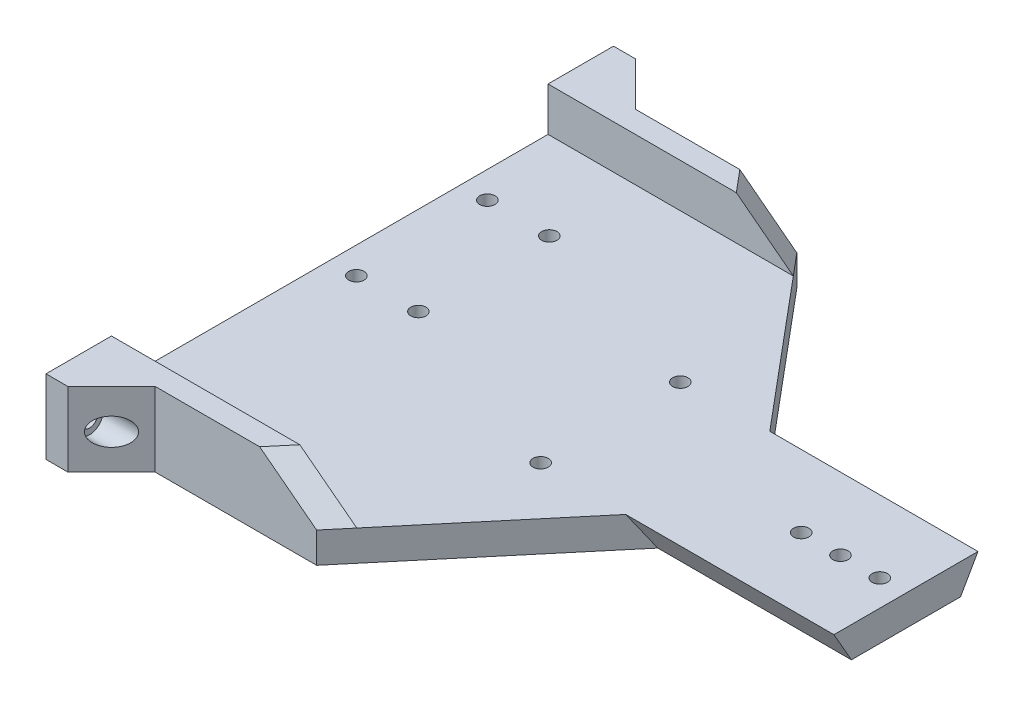
ISO-10303-21;
HEADER;
FILE_DESCRIPTION(('STEP AP214'),'2;1');
FILE_NAME('part.step','',(''),(''),'','','');
FILE_SCHEMA(('AUTOMOTIVE_DESIGN { 1 0 10303 214 1 1 1 1 }'));
ENDSEC;
DATA;
#1=APPLICATION_CONTEXT('core data for automotive mechanical design processes');
#2=APPLICATION_PROTOCOL_DEFINITION('international standard','automotive_design',2000,#1);
#3=PRODUCT_CONTEXT('',#1,'mechanical');
#4=PRODUCT('Part','Part','',(#3));
#5=PRODUCT_RELATED_PRODUCT_CATEGORY('part','',(#4));
#6=PRODUCT_DEFINITION_FORMATION('','',#4);
#7=PRODUCT_DEFINITION_CONTEXT('part definition',#1,'design');
#8=PRODUCT_DEFINITION('design','',#6,#7);
#9=PRODUCT_DEFINITION_SHAPE('','',#8);
#10=(LENGTH_UNIT() NAMED_UNIT(*) SI_UNIT(.MILLI.,.METRE.));
#11=(NAMED_UNIT(*) PLANE_ANGLE_UNIT() SI_UNIT($,.RADIAN.));
#12=(NAMED_UNIT(*) SI_UNIT($,.STERADIAN.) SOLID_ANGLE_UNIT());
#13=UNCERTAINTY_MEASURE_WITH_UNIT(LENGTH_MEASURE(1.E-05),#10,'distance_accuracy_value','');
#14=(GEOMETRIC_REPRESENTATION_CONTEXT(3) GLOBAL_UNCERTAINTY_ASSIGNED_CONTEXT((#13)) GLOBAL_UNIT_ASSIGNED_CONTEXT((#10,
#11,#12)) REPRESENTATION_CONTEXT('',''));
#15=CARTESIAN_POINT('',(0.,0.,0.));
#16=DIRECTION('',(0.,0.,1.));
#17=DIRECTION('',(1.,0.,0.));
#18=AXIS2_PLACEMENT_3D('',#15,#16,#17);
#19=CARTESIAN_POINT('',(150.,0.,0.));
#20=DIRECTION('',(1.,0.,0.));
#21=DIRECTION('',(0.,0.,-1.));
#22=AXIS2_PLACEMENT_3D('',#19,#20,#21);
#23=PLANE('',#22);
#24=CARTESIAN_POINT('',(150.,4.5,-72.5));
#25=DIRECTION('',(1.,0.,0.));
#26=DIRECTION('',(0.,0.,-1.));
#27=AXIS2_PLACEMENT_3D('',#24,#25,#26);
#28=CIRCLE('',#27,1.75);
#29=CARTESIAN_POINT('',(150.,4.5,-74.25));
#30=VERTEX_POINT('',#29);
#31=EDGE_CURVE('E42',#30,#30,#28,.T.);
#32=ORIENTED_EDGE('',*,*,#31,.T.);
#33=EDGE_LOOP('',(#32));
#34=FACE_BOUND('',#33,.T.);
#35=DIRECTION('',(0.,0.,-1.));
#36=VECTOR('',#35,1.);
#37=CARTESIAN_POINT('',(150.,3.5,0.));
#38=LINE('',#37,#36);
#39=CARTESIAN_POINT('',(150.,3.5,37.5));
#40=VERTEX_POINT('',#39);
#41=CARTESIAN_POINT('',(150.,3.5,-62.5));
#42=VERTEX_POINT('',#41);
#43=EDGE_CURVE('E47',#40,#42,#38,.T.);
#44=ORIENTED_EDGE('',*,*,#43,.T.);
#45=DIRECTION('',(0.,-1.,0.));
#46=VECTOR('',#45,1.);
#47=CARTESIAN_POINT('',(150.,13.5,-62.5));
#48=LINE('',#47,#46);
#49=CARTESIAN_POINT('',(150.,13.5,-62.5));
#50=VERTEX_POINT('',#49);
#51=EDGE_CURVE('E62',#50,#42,#48,.T.);
#52=ORIENTED_EDGE('',*,*,#51,.F.);
#53=DIRECTION('',(0.,0.,1.));
#54=VECTOR('',#53,1.);
#55=CARTESIAN_POINT('',(150.,13.5,0.));
#56=LINE('',#55,#54);
#57=CARTESIAN_POINT('',(150.,13.5,-77.5));
#58=VERTEX_POINT('',#57);
#59=EDGE_CURVE('E238',#58,#50,#56,.T.);
#60=ORIENTED_EDGE('',*,*,#59,.F.);
#61=DIRECTION('',(0.,1.,0.));
#62=VECTOR('',#61,1.);
#63=CARTESIAN_POINT('',(150.,13.5,-77.5));
#64=LINE('',#63,#62);
#65=CARTESIAN_POINT('',(150.,-3.5,-77.5));
#66=VERTEX_POINT('',#65);
#67=EDGE_CURVE('E220',#66,#58,#64,.T.);
#68=ORIENTED_EDGE('',*,*,#67,.F.);
#69=DIRECTION('',(0.,0.,-1.));
#70=VECTOR('',#69,1.);
#71=CARTESIAN_POINT('',(150.,-3.5,0.));
#72=LINE('',#71,#70);
#73=CARTESIAN_POINT('',(150.,-3.5,52.5));
#74=VERTEX_POINT('',#73);
#75=EDGE_CURVE('E241',#74,#66,#72,.T.);
#76=ORIENTED_EDGE('',*,*,#75,.F.);
#77=DIRECTION('',(0.,-1.,0.));
#78=VECTOR('',#77,1.);
#79=CARTESIAN_POINT('',(150.,13.5,52.5));
#80=LINE('',#79,#78);
#81=CARTESIAN_POINT('',(150.,13.5,52.5));
#82=VERTEX_POINT('',#81);
#83=EDGE_CURVE('E237',#82,#74,#80,.T.);
#84=ORIENTED_EDGE('',*,*,#83,.F.);
#85=DIRECTION('',(0.,0.,-1.));
#86=VECTOR('',#85,1.);
#87=CARTESIAN_POINT('',(150.,13.5,0.));
#88=LINE('',#87,#86);
#89=CARTESIAN_POINT('',(150.,13.5,37.5));
#90=VERTEX_POINT('',#89);
#91=EDGE_CURVE('E11',#82,#90,#88,.T.);
#92=ORIENTED_EDGE('',*,*,#91,.T.);
#93=DIRECTION('',(0.,1.,0.));
#94=VECTOR('',#93,1.);
#95=CARTESIAN_POINT('',(150.,13.5,37.5));
#96=LINE('',#95,#94);
#97=EDGE_CURVE('E55',#40,#90,#96,.T.);
#98=ORIENTED_EDGE('',*,*,#97,.F.);
#99=EDGE_LOOP('',(#44,#52,#60,#68,#76,#84,#92,#98));
#100=FACE_BOUND('',#99,.T.);
#101=CARTESIAN_POINT('',(150.,4.5,47.5));
#102=DIRECTION('',(1.,0.,0.));
#103=DIRECTION('',(0.,0.,-1.));
#104=AXIS2_PLACEMENT_3D('',#101,#102,#103);
#105=CIRCLE('',#104,1.75);
#106=CARTESIAN_POINT('',(150.,4.5,45.75));
#107=VERTEX_POINT('',#106);
#108=EDGE_CURVE('E243',#107,#107,#105,.F.);
#109=ORIENTED_EDGE('',*,*,#108,.F.);
#110=EDGE_LOOP('',(#109));
#111=FACE_BOUND('',#110,.T.);
#112=ADVANCED_FACE('F39',(#34,#100,#111),#23,.F.);
#113=CARTESIAN_POINT('',(282.,4.5,47.5));
#114=DIRECTION('',(-1.,0.,0.));
#115=DIRECTION('',(0.,0.,1.));
#116=AXIS2_PLACEMENT_3D('',#113,#114,#115);
#117=CYLINDRICAL_SURFACE('',#116,3.1);
#118=CARTESIAN_POINT('',(155.,4.5,47.5));
#119=DIRECTION('',(1.,0.,0.));
#120=DIRECTION('',(0.,0.,-1.));
#121=AXIS2_PLACEMENT_3D('',#118,#119,#120);
#122=CIRCLE('',#121,3.1);
#123=CARTESIAN_POINT('',(155.,4.5,44.4));
#124=VERTEX_POINT('',#123);
#125=EDGE_CURVE('E225',#124,#124,#122,.T.);
#126=ORIENTED_EDGE('',*,*,#125,.F.);
#127=EDGE_LOOP('',(#126));
#128=FACE_BOUND('',#127,.T.);
#129=CARTESIAN_POINT('',(160.,4.5,47.5));
#130=DIRECTION('',(-0.707106781186548,0.,-0.707106781186548));
#131=DIRECTION('',(-0.707106781186548,0.,0.707106781186548));
#132=AXIS2_PLACEMENT_3D('',#129,#130,#131);
#133=ELLIPSE('',#132,4.3840620433566,3.1);
#134=CARTESIAN_POINT('',(156.9,4.5,50.6));
#135=VERTEX_POINT('',#134);
#136=EDGE_CURVE('E224',#135,#135,#133,.F.);
#137=ORIENTED_EDGE('',*,*,#136,.T.);
#138=EDGE_LOOP('',(#137));
#139=FACE_BOUND('',#138,.T.);
#140=ADVANCED_FACE('F425',(#128,#139),#117,.F.);
#141=CARTESIAN_POINT('',(282.,4.5,-72.5));
#142=DIRECTION('',(-1.,0.,0.));
#143=DIRECTION('',(0.,0.,1.));
#144=AXIS2_PLACEMENT_3D('',#141,#142,#143);
#145=CYLINDRICAL_SURFACE('',#144,3.1);
#146=CARTESIAN_POINT('',(155.,4.5,-72.5));
#147=DIRECTION('',(-1.,0.,0.));
#148=DIRECTION('',(0.,0.,1.));
#149=AXIS2_PLACEMENT_3D('',#146,#147,#148);
#150=CIRCLE('',#149,3.1);
#151=CARTESIAN_POINT('',(155.,4.5,-69.4));
#152=VERTEX_POINT('',#151);
#153=EDGE_CURVE('E233',#152,#152,#150,.T.);
#154=ORIENTED_EDGE('',*,*,#153,.T.);
#155=EDGE_LOOP('',(#154));
#156=FACE_BOUND('',#155,.T.);
#157=CARTESIAN_POINT('',(160.,4.5,-72.5));
#158=DIRECTION('',(-0.707106781186548,0.,0.707106781186548));
#159=DIRECTION('',(-0.707106781186548,0.,-0.707106781186548));
#160=AXIS2_PLACEMENT_3D('',#157,#158,#159);
#161=ELLIPSE('',#160,4.3840620433566,3.1);
#162=CARTESIAN_POINT('',(156.9,4.5,-75.6));
#163=VERTEX_POINT('',#162);
#164=EDGE_CURVE('E232',#163,#163,#161,.T.);
#165=ORIENTED_EDGE('',*,*,#164,.F.);
#166=EDGE_LOOP('',(#165));
#167=FACE_BOUND('',#166,.T.);
#168=ADVANCED_FACE('F429',(#156,#167),#145,.F.);
#169=CARTESIAN_POINT('',(202.,3.5,42.5));
#170=DIRECTION('',(-0.766044443118982,0.,-0.642787609686535));
#171=DIRECTION('',(-0.642787609686535,0.,0.766044443118982));
#172=AXIS2_PLACEMENT_3D('',#169,#170,#171);
#173=PLANE('',#172);
#174=DIRECTION('',(0.642787609686535,0.,-0.766044443118982));
#175=VECTOR('',#174,1.);
#176=CARTESIAN_POINT('',(202.,3.5,42.5));
#177=LINE('',#176,#175);
#178=CARTESIAN_POINT('',(206.195498155886,3.5,37.5));
#179=VERTEX_POINT('',#178);
#180=CARTESIAN_POINT('',(234.305335800325,3.5,4.));
#181=VERTEX_POINT('',#180);
#182=EDGE_CURVE('E196',#179,#181,#177,.T.);
#183=ORIENTED_EDGE('',*,*,#182,.F.);
#184=DIRECTION('',(-0.642787609686535,0.,0.766044443118982));
#185=VECTOR('',#184,1.);
#186=CARTESIAN_POINT('',(202.,3.49999999999991,42.5));
#187=LINE('',#186,#185);
#188=CARTESIAN_POINT('',(202.,3.49999999999991,42.5));
#189=VERTEX_POINT('',#188);
#190=EDGE_CURVE('E216',#179,#189,#187,.T.);
#191=ORIENTED_EDGE('',*,*,#190,.T.);
#192=DIRECTION('',(0.,-1.,0.));
#193=VECTOR('',#192,1.);
#194=CARTESIAN_POINT('',(202.,3.5,42.5));
#195=LINE('',#194,#193);
#196=CARTESIAN_POINT('',(202.,-3.5,42.5));
#197=VERTEX_POINT('',#196);
#198=EDGE_CURVE('E199',#189,#197,#195,.T.);
#199=ORIENTED_EDGE('',*,*,#198,.T.);
#200=DIRECTION('',(0.642787609686535,0.,-0.766044443118982));
#201=VECTOR('',#200,1.);
#202=CARTESIAN_POINT('',(202.,-3.5,42.5));
#203=LINE('',#202,#201);
#204=CARTESIAN_POINT('',(237.661734325034,-3.5,0.));
#205=VERTEX_POINT('',#204);
#206=EDGE_CURVE('E349',#197,#205,#203,.T.);
#207=ORIENTED_EDGE('',*,*,#206,.T.);
#208=DIRECTION('',(0.384334803490757,-0.801556669933433,-0.458032382819104));
#209=VECTOR('',#208,1.);
#210=CARTESIAN_POINT('',(199.695039798349,75.6821530519329,45.2469446011045));
#211=LINE('',#210,#209);
#212=EDGE_CURVE('E289',#181,#205,#211,.T.);
#213=ORIENTED_EDGE('',*,*,#212,.F.);
#214=EDGE_LOOP('',(#183,#191,#199,#207,#213));
#215=FACE_BOUND('',#214,.T.);
#216=ADVANCED_FACE('F367',(#215),#173,.F.);
#217=CARTESIAN_POINT('',(-0.002000000000002,3.5,4.));
#218=DIRECTION('',(0.,-0.496138938356833,0.86824314212446));
#219=DIRECTION('',(0.,-0.86824314212446,-0.496138938356833));
#220=AXIS2_PLACEMENT_3D('',#217,#218,#219);
#221=PLANE('',#220);
#222=DIRECTION('',(1.,0.,0.));
#223=VECTOR('',#222,1.);
#224=CARTESIAN_POINT('',(-0.002000000000002,3.5,4.));
#225=LINE('',#224,#223);
#226=CARTESIAN_POINT('',(282.,3.5,4.));
#227=VERTEX_POINT('',#226);
#228=EDGE_CURVE('E292',#181,#227,#225,.T.);
#229=ORIENTED_EDGE('',*,*,#228,.F.);
#230=ORIENTED_EDGE('',*,*,#212,.T.);
#231=DIRECTION('',(1.,0.,0.));
#232=VECTOR('',#231,1.);
#233=CARTESIAN_POINT('',(282.,-3.5,0.));
#234=LINE('',#233,#232);
#235=CARTESIAN_POINT('',(282.,-3.5,0.));
#236=VERTEX_POINT('',#235);
#237=EDGE_CURVE('E191',#205,#236,#234,.T.);
#238=ORIENTED_EDGE('',*,*,#237,.T.);
#239=DIRECTION('',(0.,-0.86824314212446,-0.496138938356833));
#240=VECTOR('',#239,1.);
#241=CARTESIAN_POINT('',(282.,3.5,4.));
#242=LINE('',#241,#240);
#243=EDGE_CURVE('E293',#227,#236,#242,.T.);
#244=ORIENTED_EDGE('',*,*,#243,.F.);
#245=EDGE_LOOP('',(#229,#230,#238,#244));
#246=FACE_BOUND('',#245,.T.);
#247=ADVANCED_FACE('F355',(#246),#221,.T.);
#248=CARTESIAN_POINT('',(282.,3.5,-25.));
#249=DIRECTION('',(-1.,0.,0.));
#250=DIRECTION('',(0.,0.,1.));
#251=AXIS2_PLACEMENT_3D('',#248,#249,#250);
#252=PLANE('',#251);
#253=DIRECTION('',(0.,0.,-1.));
#254=VECTOR('',#253,1.);
#255=CARTESIAN_POINT('',(282.,-3.5,-25.));
#256=LINE('',#255,#254);
#257=CARTESIAN_POINT('',(282.,-3.5,-25.));
#258=VERTEX_POINT('',#257);
#259=EDGE_CURVE('E189',#236,#258,#256,.T.);
#260=ORIENTED_EDGE('',*,*,#259,.T.);
#261=DIRECTION('',(0.,0.86824314212446,-0.496138938356833));
#262=VECTOR('',#261,1.);
#263=CARTESIAN_POINT('',(282.,3.5,-29.));
#264=LINE('',#263,#262);
#265=CARTESIAN_POINT('',(282.,3.5,-29.));
#266=VERTEX_POINT('',#265);
#267=EDGE_CURVE('E188',#258,#266,#264,.T.);
#268=ORIENTED_EDGE('',*,*,#267,.T.);
#269=DIRECTION('',(0.,0.,-1.));
#270=VECTOR('',#269,1.);
#271=CARTESIAN_POINT('',(282.,3.5,-25.));
#272=LINE('',#271,#270);
#273=EDGE_CURVE('E344',#227,#266,#272,.T.);
#274=ORIENTED_EDGE('',*,*,#273,.F.);
#275=ORIENTED_EDGE('',*,*,#243,.T.);
#276=EDGE_LOOP('',(#260,#268,#274,#275));
#277=FACE_BOUND('',#276,.T.);
#278=ADVANCED_FACE('F358',(#277),#252,.F.);
#279=CARTESIAN_POINT('',(-0.002000000000002,3.5,-29.));
#280=DIRECTION('',(0.,-0.496138938356833,-0.86824314212446));
#281=DIRECTION('',(0.,0.86824314212446,-0.496138938356833));
#282=AXIS2_PLACEMENT_3D('',#279,#280,#281);
#283=PLANE('',#282);
#284=DIRECTION('',(-1.,0.,0.));
#285=VECTOR('',#284,1.);
#286=CARTESIAN_POINT('',(282.,-3.5,-25.));
#287=LINE('',#286,#285);
#288=CARTESIAN_POINT('',(237.661734325035,-3.5,-25.));
#289=VERTEX_POINT('',#288);
#290=EDGE_CURVE('E166',#258,#289,#287,.T.);
#291=ORIENTED_EDGE('',*,*,#290,.T.);
#292=DIRECTION('',(-0.384334803490762,0.801556669933432,-0.458032382819103));
#293=VECTOR('',#292,1.);
#294=CARTESIAN_POINT('',(199.695039798348,75.6821530519339,-70.246944601105));
#295=LINE('',#294,#293);
#296=CARTESIAN_POINT('',(234.305335800325,3.5,-29.));
#297=VERTEX_POINT('',#296);
#298=EDGE_CURVE('E175',#289,#297,#295,.T.);
#299=ORIENTED_EDGE('',*,*,#298,.T.);
#300=DIRECTION('',(1.,0.,0.));
#301=VECTOR('',#300,1.);
#302=CARTESIAN_POINT('',(-0.002000000000002,3.5,-29.));
#303=LINE('',#302,#301);
#304=EDGE_CURVE('E183',#297,#266,#303,.T.);
#305=ORIENTED_EDGE('',*,*,#304,.T.);
#306=ORIENTED_EDGE('',*,*,#267,.F.);
#307=EDGE_LOOP('',(#291,#299,#305,#306));
#308=FACE_BOUND('',#307,.T.);
#309=ADVANCED_FACE('F186',(#308),#283,.T.);
#310=CARTESIAN_POINT('',(202.,3.5,-67.5));
#311=DIRECTION('',(-0.766044443118976,0.,0.642787609686541));
#312=DIRECTION('',(0.642787609686541,0.,0.766044443118977));
#313=AXIS2_PLACEMENT_3D('',#310,#311,#312);
#314=PLANE('',#313);
#315=DIRECTION('',(0.,-1.,0.));
#316=VECTOR('',#315,1.);
#317=CARTESIAN_POINT('',(202.,3.5,-67.5));
#318=LINE('',#317,#316);
#319=CARTESIAN_POINT('',(202.,3.49999999999993,-67.5));
#320=VERTEX_POINT('',#319);
#321=CARTESIAN_POINT('',(202.,-3.5,-67.5));
#322=VERTEX_POINT('',#321);
#323=EDGE_CURVE('E197',#320,#322,#318,.T.);
#324=ORIENTED_EDGE('',*,*,#323,.F.);
#325=DIRECTION('',(0.642787609686541,0.,0.766044443118977));
#326=VECTOR('',#325,1.);
#327=CARTESIAN_POINT('',(202.,3.49999999999993,-67.5));
#328=LINE('',#327,#326);
#329=CARTESIAN_POINT('',(206.195498155886,3.5,-62.5));
#330=VERTEX_POINT('',#329);
#331=EDGE_CURVE('E214',#320,#330,#328,.T.);
#332=ORIENTED_EDGE('',*,*,#331,.T.);
#333=DIRECTION('',(-0.642787609686541,0.,-0.766044443118976));
#334=VECTOR('',#333,1.);
#335=CARTESIAN_POINT('',(202.,3.5,-67.5));
#336=LINE('',#335,#334);
#337=EDGE_CURVE('E179',#297,#330,#336,.T.);
#338=ORIENTED_EDGE('',*,*,#337,.F.);
#339=ORIENTED_EDGE('',*,*,#298,.F.);
#340=DIRECTION('',(-0.642787609686541,0.,-0.766044443118976));
#341=VECTOR('',#340,1.);
#342=CARTESIAN_POINT('',(202.,-3.5,-67.5));
#343=LINE('',#342,#341);
#344=EDGE_CURVE('E161',#289,#322,#343,.T.);
#345=ORIENTED_EDGE('',*,*,#344,.T.);
#346=EDGE_LOOP('',(#324,#332,#338,#339,#345));
#347=FACE_BOUND('',#346,.T.);
#348=ADVANCED_FACE('F176',(#347),#314,.F.);
#349=CARTESIAN_POINT('',(214.305335800325,-3.5,3.49999999999998));
#350=DIRECTION('',(0.,1.,0.));
#351=DIRECTION('',(0.,0.,1.));
#352=AXIS2_PLACEMENT_3D('',#349,#350,#351);
#353=CYLINDRICAL_SURFACE('',#352,1.74999999999998);
#354=CARTESIAN_POINT('',(214.305335800325,-3.5,3.49999999999998));
#355=DIRECTION('',(0.,1.,0.));
#356=DIRECTION('',(0.,0.,1.));
#357=AXIS2_PLACEMENT_3D('',#354,#355,#356);
#358=CIRCLE('',#357,1.74999999999998);
#359=CARTESIAN_POINT('',(214.305335800325,-3.5,5.24999999999996));
#360=VERTEX_POINT('',#359);
#361=EDGE_CURVE('E228',#360,#360,#358,.T.);
#362=ORIENTED_EDGE('',*,*,#361,.F.);
#363=EDGE_LOOP('',(#362));
#364=FACE_BOUND('',#363,.T.);
#365=CARTESIAN_POINT('',(214.305335800325,3.5,3.49999999999998));
#366=DIRECTION('',(0.,1.,0.));
#367=DIRECTION('',(0.,0.,1.));
#368=AXIS2_PLACEMENT_3D('',#365,#366,#367);
#369=CIRCLE('',#368,1.74999999999998);
#370=CARTESIAN_POINT('',(214.305335800325,3.5,5.24999999999996));
#371=VERTEX_POINT('',#370);
#372=EDGE_CURVE('E282',#371,#371,#369,.T.);
#373=ORIENTED_EDGE('',*,*,#372,.T.);
#374=EDGE_LOOP('',(#373));
#375=FACE_BOUND('',#374,.T.);
#376=ADVANCED_FACE('F446',(#364,#375),#353,.F.);
#377=CARTESIAN_POINT('',(214.305335800325,-3.5,-28.5));
#378=DIRECTION('',(0.,1.,0.));
#379=DIRECTION('',(0.,0.,1.));
#380=AXIS2_PLACEMENT_3D('',#377,#378,#379);
#381=CYLINDRICAL_SURFACE('',#380,1.74999999999998);
#382=CARTESIAN_POINT('',(214.305335800325,-3.5,-28.5));
#383=DIRECTION('',(0.,1.,0.));
#384=DIRECTION('',(0.,0.,1.));
#385=AXIS2_PLACEMENT_3D('',#382,#383,#384);
#386=CIRCLE('',#385,1.74999999999998);
#387=CARTESIAN_POINT('',(214.305335800325,-3.5,-26.75));
#388=VERTEX_POINT('',#387);
#389=EDGE_CURVE('E184',#388,#388,#386,.T.);
#390=ORIENTED_EDGE('',*,*,#389,.F.);
#391=EDGE_LOOP('',(#390));
#392=FACE_BOUND('',#391,.T.);
#393=CARTESIAN_POINT('',(214.305335800325,3.5,-28.5));
#394=DIRECTION('',(0.,1.,0.));
#395=DIRECTION('',(0.,0.,1.));
#396=AXIS2_PLACEMENT_3D('',#393,#394,#395);
#397=CIRCLE('',#396,1.74999999999998);
#398=CARTESIAN_POINT('',(214.305335800325,3.5,-26.75));
#399=VERTEX_POINT('',#398);
#400=EDGE_CURVE('E279',#399,#399,#397,.T.);
#401=ORIENTED_EDGE('',*,*,#400,.T.);
#402=EDGE_LOOP('',(#401));
#403=FACE_BOUND('',#402,.T.);
#404=ADVANCED_FACE('F442',(#392,#403),#381,.F.);
#405=CARTESIAN_POINT('',(276.,-3.5,-12.5));
#406=DIRECTION('',(0.,1.,0.));
#407=DIRECTION('',(0.,0.,1.));
#408=AXIS2_PLACEMENT_3D('',#405,#406,#407);
#409=CYLINDRICAL_SURFACE('',#408,1.75000000000004);
#410=CARTESIAN_POINT('',(276.,-3.5,-12.5));
#411=DIRECTION('',(0.,1.,0.));
#412=DIRECTION('',(0.,0.,1.));
#413=AXIS2_PLACEMENT_3D('',#410,#411,#412);
#414=CIRCLE('',#413,1.75000000000004);
#415=CARTESIAN_POINT('',(276.,-3.5,-10.75));
#416=VERTEX_POINT('',#415);
#417=EDGE_CURVE('E856',#416,#416,#414,.T.);
#418=ORIENTED_EDGE('',*,*,#417,.F.);
#419=EDGE_LOOP('',(#418));
#420=FACE_BOUND('',#419,.T.);
#421=CARTESIAN_POINT('',(276.,3.5,-12.5));
#422=DIRECTION('',(0.,1.,0.));
#423=DIRECTION('',(0.,0.,1.));
#424=AXIS2_PLACEMENT_3D('',#421,#422,#423);
#425=CIRCLE('',#424,1.75000000000004);
#426=CARTESIAN_POINT('',(276.,3.5,-10.75));
#427=VERTEX_POINT('',#426);
#428=EDGE_CURVE('E848',#427,#427,#425,.T.);
#429=ORIENTED_EDGE('',*,*,#428,.T.);
#430=EDGE_LOOP('',(#429));
#431=FACE_BOUND('',#430,.T.);
#432=ADVANCED_FACE('F445',(#420,#431),#409,.F.);
#433=CARTESIAN_POINT('',(267.,-3.5,-12.5));
#434=DIRECTION('',(0.,1.,0.));
#435=DIRECTION('',(0.,0.,1.));
#436=AXIS2_PLACEMENT_3D('',#433,#434,#435);
#437=CYLINDRICAL_SURFACE('',#436,1.74999999999998);
#438=CARTESIAN_POINT('',(267.,-3.5,-12.5));
#439=DIRECTION('',(0.,1.,0.));
#440=DIRECTION('',(0.,0.,1.));
#441=AXIS2_PLACEMENT_3D('',#438,#439,#440);
#442=CIRCLE('',#441,1.74999999999998);
#443=CARTESIAN_POINT('',(267.,-3.5,-10.75));
#444=VERTEX_POINT('',#443);
#445=EDGE_CURVE('E855',#444,#444,#442,.T.);
#446=ORIENTED_EDGE('',*,*,#445,.F.);
#447=EDGE_LOOP('',(#446));
#448=FACE_BOUND('',#447,.T.);
#449=CARTESIAN_POINT('',(267.,3.5,-12.5));
#450=DIRECTION('',(0.,1.,0.));
#451=DIRECTION('',(0.,0.,1.));
#452=AXIS2_PLACEMENT_3D('',#449,#450,#451);
#453=CIRCLE('',#452,1.74999999999998);
#454=CARTESIAN_POINT('',(267.,3.5,-10.75));
#455=VERTEX_POINT('',#454);
#456=EDGE_CURVE('E844',#455,#455,#453,.T.);
#457=ORIENTED_EDGE('',*,*,#456,.T.);
#458=EDGE_LOOP('',(#457));
#459=FACE_BOUND('',#458,.T.);
#460=ADVANCED_FACE('F712',(#448,#459),#437,.F.);
#461=CARTESIAN_POINT('',(258.,-3.5,-12.5));
#462=DIRECTION('',(0.,1.,0.));
#463=DIRECTION('',(0.,0.,1.));
#464=AXIS2_PLACEMENT_3D('',#461,#462,#463);
#465=CYLINDRICAL_SURFACE('',#464,1.75000000000004);
#466=CARTESIAN_POINT('',(258.,-3.5,-12.5));
#467=DIRECTION('',(0.,1.,0.));
#468=DIRECTION('',(0.,0.,1.));
#469=AXIS2_PLACEMENT_3D('',#466,#467,#468);
#470=CIRCLE('',#469,1.75000000000004);
#471=CARTESIAN_POINT('',(258.,-3.5,-10.75));
#472=VERTEX_POINT('',#471);
#473=EDGE_CURVE('E884',#472,#472,#470,.T.);
#474=ORIENTED_EDGE('',*,*,#473,.F.);
#475=EDGE_LOOP('',(#474));
#476=FACE_BOUND('',#475,.T.);
#477=CARTESIAN_POINT('',(258.,3.5,-12.5));
#478=DIRECTION('',(0.,1.,0.));
#479=DIRECTION('',(0.,0.,1.));
#480=AXIS2_PLACEMENT_3D('',#477,#478,#479);
#481=CIRCLE('',#480,1.75000000000004);
#482=CARTESIAN_POINT('',(258.,3.5,-10.75));
#483=VERTEX_POINT('',#482);
#484=EDGE_CURVE('E840',#483,#483,#481,.T.);
#485=ORIENTED_EDGE('',*,*,#484,.T.);
#486=EDGE_LOOP('',(#485));
#487=FACE_BOUND('',#486,.T.);
#488=ADVANCED_FACE('F723',(#476,#487),#465,.F.);
#489=CARTESIAN_POINT('',(170.3,-3.5,-42.5));
#490=DIRECTION('',(0.,1.,0.));
#491=DIRECTION('',(0.,0.,1.));
#492=AXIS2_PLACEMENT_3D('',#489,#490,#491);
#493=CYLINDRICAL_SURFACE('',#492,1.75000000000001);
#494=CARTESIAN_POINT('',(170.3,-3.5,-42.5));
#495=DIRECTION('',(0.,1.,0.));
#496=DIRECTION('',(0.,0.,1.));
#497=AXIS2_PLACEMENT_3D('',#494,#495,#496);
#498=CIRCLE('',#497,1.75000000000001);
#499=CARTESIAN_POINT('',(170.3,-3.5,-40.75));
#500=VERTEX_POINT('',#499);
#501=EDGE_CURVE('E870',#500,#500,#498,.T.);
#502=ORIENTED_EDGE('',*,*,#501,.F.);
#503=EDGE_LOOP('',(#502));
#504=FACE_BOUND('',#503,.T.);
#505=CARTESIAN_POINT('',(170.3,3.5,-42.5));
#506=DIRECTION('',(0.,1.,0.));
#507=DIRECTION('',(0.,0.,1.));
#508=AXIS2_PLACEMENT_3D('',#505,#506,#507);
#509=CIRCLE('',#508,1.75000000000001);
#510=CARTESIAN_POINT('',(170.3,3.5,-40.75));
#511=VERTEX_POINT('',#510);
#512=EDGE_CURVE('E836',#511,#511,#509,.T.);
#513=ORIENTED_EDGE('',*,*,#512,.T.);
#514=EDGE_LOOP('',(#513));
#515=FACE_BOUND('',#514,.T.);
#516=ADVANCED_FACE('F734',(#504,#515),#493,.F.);
#517=CARTESIAN_POINT('',(156.1,-3.5,-12.5));
#518=DIRECTION('',(0.,1.,0.));
#519=DIRECTION('',(0.,0.,1.));
#520=AXIS2_PLACEMENT_3D('',#517,#518,#519);
#521=CYLINDRICAL_SURFACE('',#520,1.75000000000001);
#522=CARTESIAN_POINT('',(156.1,-3.5,-12.5));
#523=DIRECTION('',(0.,1.,0.));
#524=DIRECTION('',(0.,0.,1.));
#525=AXIS2_PLACEMENT_3D('',#522,#523,#524);
#526=CIRCLE('',#525,1.75000000000001);
#527=CARTESIAN_POINT('',(156.1,-3.5,-10.75));
#528=VERTEX_POINT('',#527);
#529=EDGE_CURVE('E865',#528,#528,#526,.T.);
#530=ORIENTED_EDGE('',*,*,#529,.F.);
#531=EDGE_LOOP('',(#530));
#532=FACE_BOUND('',#531,.T.);
#533=CARTESIAN_POINT('',(156.1,3.5,-12.5));
#534=DIRECTION('',(0.,1.,0.));
#535=DIRECTION('',(0.,0.,1.));
#536=AXIS2_PLACEMENT_3D('',#533,#534,#535);
#537=CIRCLE('',#536,1.75000000000001);
#538=CARTESIAN_POINT('',(156.1,3.5,-10.75));
#539=VERTEX_POINT('',#538);
#540=EDGE_CURVE('E832',#539,#539,#537,.T.);
#541=ORIENTED_EDGE('',*,*,#540,.T.);
#542=EDGE_LOOP('',(#541));
#543=FACE_BOUND('',#542,.T.);
#544=ADVANCED_FACE('F745',(#532,#543),#521,.F.);
#545=CARTESIAN_POINT('',(170.3,-3.5,-12.5));
#546=DIRECTION('',(0.,1.,0.));
#547=DIRECTION('',(0.,0.,1.));
#548=AXIS2_PLACEMENT_3D('',#545,#546,#547);
#549=CYLINDRICAL_SURFACE('',#548,1.75000000000001);
#550=CARTESIAN_POINT('',(170.3,-3.5,-12.5));
#551=DIRECTION('',(0.,1.,0.));
#552=DIRECTION('',(0.,0.,1.));
#553=AXIS2_PLACEMENT_3D('',#550,#551,#552);
#554=CIRCLE('',#553,1.75000000000001);
#555=CARTESIAN_POINT('',(170.3,-3.5,-10.75));
#556=VERTEX_POINT('',#555);
#557=EDGE_CURVE('E866',#556,#556,#554,.T.);
#558=ORIENTED_EDGE('',*,*,#557,.F.);
#559=EDGE_LOOP('',(#558));
#560=FACE_BOUND('',#559,.T.);
#561=CARTESIAN_POINT('',(170.3,3.5,-12.5));
#562=DIRECTION('',(0.,1.,0.));
#563=DIRECTION('',(0.,0.,1.));
#564=AXIS2_PLACEMENT_3D('',#561,#562,#563);
#565=CIRCLE('',#564,1.75000000000001);
#566=CARTESIAN_POINT('',(170.3,3.5,-10.75));
#567=VERTEX_POINT('',#566);
#568=EDGE_CURVE('E828',#567,#567,#565,.T.);
#569=ORIENTED_EDGE('',*,*,#568,.T.);
#570=EDGE_LOOP('',(#569));
#571=FACE_BOUND('',#570,.T.);
#572=ADVANCED_FACE('F756',(#560,#571),#549,.F.);
#573=CARTESIAN_POINT('',(156.1,-3.5,-42.5));
#574=DIRECTION('',(0.,1.,0.));
#575=DIRECTION('',(0.,0.,1.));
#576=AXIS2_PLACEMENT_3D('',#573,#574,#575);
#577=CYLINDRICAL_SURFACE('',#576,1.75000000000001);
#578=CARTESIAN_POINT('',(156.1,-3.5,-42.5));
#579=DIRECTION('',(0.,1.,0.));
#580=DIRECTION('',(0.,0.,1.));
#581=AXIS2_PLACEMENT_3D('',#578,#579,#580);
#582=CIRCLE('',#581,1.75000000000001);
#583=CARTESIAN_POINT('',(156.1,-3.5,-40.75));
#584=VERTEX_POINT('',#583);
#585=EDGE_CURVE('E271',#584,#584,#582,.T.);
#586=ORIENTED_EDGE('',*,*,#585,.F.);
#587=EDGE_LOOP('',(#586));
#588=FACE_BOUND('',#587,.T.);
#589=CARTESIAN_POINT('',(156.1,3.5,-42.5));
#590=DIRECTION('',(0.,1.,0.));
#591=DIRECTION('',(0.,0.,1.));
#592=AXIS2_PLACEMENT_3D('',#589,#590,#591);
#593=CIRCLE('',#592,1.75000000000001);
#594=CARTESIAN_POINT('',(156.1,3.5,-40.75));
#595=VERTEX_POINT('',#594);
#596=EDGE_CURVE('E268',#595,#595,#593,.T.);
#597=ORIENTED_EDGE('',*,*,#596,.T.);
#598=EDGE_LOOP('',(#597));
#599=FACE_BOUND('',#598,.T.);
#600=ADVANCED_FACE('F477',(#588,#599),#577,.F.);
#601=CARTESIAN_POINT('',(52.,3.5,-67.5));
#602=DIRECTION('',(0.,0.,1.));
#603=DIRECTION('',(1.,0.,0.));
#604=AXIS2_PLACEMENT_3D('',#601,#602,#603);
#605=PLANE('',#604);
#606=DIRECTION('',(-1.,0.,0.));
#607=VECTOR('',#606,1.);
#608=CARTESIAN_POINT('',(52.,13.5,-67.5));
#609=LINE('',#608,#607);
#610=CARTESIAN_POINT('',(188.945927106677,13.5,-67.5));
#611=VERTEX_POINT('',#610);
#612=CARTESIAN_POINT('',(165.,13.5,-67.5));
#613=VERTEX_POINT('',#612);
#614=EDGE_CURVE('E338',#611,#613,#609,.T.);
#615=ORIENTED_EDGE('',*,*,#614,.F.);
#616=DIRECTION('',(-0.793844806099451,0.608120402411336,0.));
#617=VECTOR('',#616,1.);
#618=CARTESIAN_POINT('',(160.694122609366,35.1421378432481,-67.5));
#619=LINE('',#618,#617);
#620=EDGE_CURVE('E212',#611,#320,#619,.F.);
#621=ORIENTED_EDGE('',*,*,#620,.T.);
#622=ORIENTED_EDGE('',*,*,#323,.T.);
#623=DIRECTION('',(-1.,0.,0.));
#624=VECTOR('',#623,1.);
#625=CARTESIAN_POINT('',(52.,-3.5,-67.5));
#626=LINE('',#625,#624);
#627=CARTESIAN_POINT('',(165.,-3.5,-67.5));
#628=VERTEX_POINT('',#627);
#629=EDGE_CURVE('E170',#322,#628,#626,.T.);
#630=ORIENTED_EDGE('',*,*,#629,.T.);
#631=DIRECTION('',(0.,-1.,0.));
#632=VECTOR('',#631,1.);
#633=CARTESIAN_POINT('',(165.,13.5,-67.5));
#634=LINE('',#633,#632);
#635=EDGE_CURVE('E296',#613,#628,#634,.T.);
#636=ORIENTED_EDGE('',*,*,#635,.F.);
#637=EDGE_LOOP('',(#615,#621,#622,#630,#636));
#638=FACE_BOUND('',#637,.T.);
#639=ADVANCED_FACE('F399',(#638),#605,.F.);
#640=CARTESIAN_POINT('',(144.115283177332,13.5,-120.927080961109));
#641=DIRECTION('',(-0.541675220419697,-0.707106781186553,0.454519477672042));
#642=DIRECTION('',(-0.642787609686541,0.,-0.766044443118977));
#643=AXIS2_PLACEMENT_3D('',#640,#641,#642);
#644=PLANE('',#643);
#645=DIRECTION('',(0.79384480609945,-0.608120402411336,0.));
#646=VECTOR('',#645,1.);
#647=CARTESIAN_POINT('',(162.245661560568,37.1675280998299,-62.5));
#648=LINE('',#647,#646);
#649=CARTESIAN_POINT('',(193.141425262563,13.5,-62.5));
#650=VERTEX_POINT('',#649);
#651=EDGE_CURVE('E209',#330,#650,#648,.F.);
#652=ORIENTED_EDGE('',*,*,#651,.F.);
#653=ORIENTED_EDGE('',*,*,#331,.F.);
#654=ORIENTED_EDGE('',*,*,#620,.F.);
#655=DIRECTION('',(-0.642787609686541,0.,-0.766044443118977));
#656=VECTOR('',#655,1.);
#657=CARTESIAN_POINT('',(144.115283177332,13.5,-120.927080961109));
#658=LINE('',#657,#656);
#659=EDGE_CURVE('E206',#650,#611,#658,.T.);
#660=ORIENTED_EDGE('',*,*,#659,.F.);
#661=EDGE_LOOP('',(#652,#653,#654,#660));
#662=FACE_BOUND('',#661,.T.);
#663=ADVANCED_FACE('F403',(#662),#644,.F.);
#664=CARTESIAN_POINT('',(206.195498155886,13.5,-62.5));
#665=DIRECTION('',(0.,0.,-1.));
#666=DIRECTION('',(-1.,0.,0.));
#667=AXIS2_PLACEMENT_3D('',#664,#665,#666);
#668=PLANE('',#667);
#669=DIRECTION('',(1.,0.,0.));
#670=VECTOR('',#669,1.);
#671=CARTESIAN_POINT('',(206.195498155886,13.5,-62.5));
#672=LINE('',#671,#670);
#673=EDGE_CURVE('E336',#50,#650,#672,.T.);
#674=ORIENTED_EDGE('',*,*,#673,.F.);
#675=ORIENTED_EDGE('',*,*,#51,.T.);
#676=DIRECTION('',(1.,0.,0.));
#677=VECTOR('',#676,1.);
#678=CARTESIAN_POINT('',(206.195498155886,3.5,-62.5));
#679=LINE('',#678,#677);
#680=EDGE_CURVE('E330',#42,#330,#679,.T.);
#681=ORIENTED_EDGE('',*,*,#680,.T.);
#682=ORIENTED_EDGE('',*,*,#651,.T.);
#683=EDGE_LOOP('',(#674,#675,#681,#682));
#684=FACE_BOUND('',#683,.T.);
#685=ADVANCED_FACE('F405',(#684),#668,.F.);
#686=CARTESIAN_POINT('',(0.,3.5,0.));
#687=DIRECTION('',(0.,1.,0.));
#688=DIRECTION('',(0.,0.,1.));
#689=AXIS2_PLACEMENT_3D('',#686,#687,#688);
#690=PLANE('',#689);
#691=ORIENTED_EDGE('',*,*,#43,.F.);
#692=DIRECTION('',(-1.,0.,0.));
#693=VECTOR('',#692,1.);
#694=CARTESIAN_POINT('',(206.195498155886,3.5,37.5));
#695=LINE('',#694,#693);
#696=EDGE_CURVE('E328',#179,#40,#695,.T.);
#697=ORIENTED_EDGE('',*,*,#696,.F.);
#698=ORIENTED_EDGE('',*,*,#182,.T.);
#699=ORIENTED_EDGE('',*,*,#228,.T.);
#700=ORIENTED_EDGE('',*,*,#273,.T.);
#701=ORIENTED_EDGE('',*,*,#304,.F.);
#702=ORIENTED_EDGE('',*,*,#337,.T.);
#703=ORIENTED_EDGE('',*,*,#680,.F.);
#704=EDGE_LOOP('',(#691,#697,#698,#699,#700,#701,#702,#703));
#705=FACE_BOUND('',#704,.T.);
#706=ORIENTED_EDGE('',*,*,#596,.F.);
#707=EDGE_LOOP('',(#706));
#708=FACE_BOUND('',#707,.T.);
#709=ORIENTED_EDGE('',*,*,#568,.F.);
#710=EDGE_LOOP('',(#709));
#711=FACE_BOUND('',#710,.T.);
#712=ORIENTED_EDGE('',*,*,#540,.F.);
#713=EDGE_LOOP('',(#712));
#714=FACE_BOUND('',#713,.T.);
#715=ORIENTED_EDGE('',*,*,#512,.F.);
#716=EDGE_LOOP('',(#715));
#717=FACE_BOUND('',#716,.T.);
#718=ORIENTED_EDGE('',*,*,#484,.F.);
#719=EDGE_LOOP('',(#718));
#720=FACE_BOUND('',#719,.T.);
#721=ORIENTED_EDGE('',*,*,#456,.F.);
#722=EDGE_LOOP('',(#721));
#723=FACE_BOUND('',#722,.T.);
#724=ORIENTED_EDGE('',*,*,#428,.F.);
#725=EDGE_LOOP('',(#724));
#726=FACE_BOUND('',#725,.T.);
#727=ORIENTED_EDGE('',*,*,#400,.F.);
#728=EDGE_LOOP('',(#727));
#729=FACE_BOUND('',#728,.T.);
#730=ORIENTED_EDGE('',*,*,#372,.F.);
#731=EDGE_LOOP('',(#730));
#732=FACE_BOUND('',#731,.T.);
#733=ADVANCED_FACE('F361',(#705,#708,#711,#714,#717,#720,#723,#726,#729,#732),#690,.T.);
#734=CARTESIAN_POINT('',(206.195498155886,13.5,37.5));
#735=DIRECTION('',(0.,0.,1.));
#736=DIRECTION('',(1.,0.,0.));
#737=AXIS2_PLACEMENT_3D('',#734,#735,#736);
#738=PLANE('',#737);
#739=ORIENTED_EDGE('',*,*,#696,.T.);
#740=ORIENTED_EDGE('',*,*,#97,.T.);
#741=DIRECTION('',(-1.,0.,0.));
#742=VECTOR('',#741,1.);
#743=CARTESIAN_POINT('',(206.195498155886,13.5,37.5));
#744=LINE('',#743,#742);
#745=CARTESIAN_POINT('',(193.141425262563,13.5,37.5));
#746=VERTEX_POINT('',#745);
#747=EDGE_CURVE('E331',#746,#90,#744,.T.);
#748=ORIENTED_EDGE('',*,*,#747,.F.);
#749=DIRECTION('',(0.793844806099447,-0.608120402411342,0.));
#750=VECTOR('',#749,1.);
#751=CARTESIAN_POINT('',(154.48796680456,43.1102670590834,37.5));
#752=LINE('',#751,#750);
#753=EDGE_CURVE('E204',#746,#179,#752,.T.);
#754=ORIENTED_EDGE('',*,*,#753,.T.);
#755=EDGE_LOOP('',(#739,#740,#748,#754));
#756=FACE_BOUND('',#755,.T.);
#757=ADVANCED_FACE('F407',(#756),#738,.F.);
#758=CARTESIAN_POINT('',(131.805186264681,13.5,110.597683181945));
#759=DIRECTION('',(0.541675220419702,0.707106781186551,0.454519477672039));
#760=DIRECTION('',(-0.642787609686535,0.,0.766044443118982));
#761=AXIS2_PLACEMENT_3D('',#758,#759,#760);
#762=PLANE('',#761);
#763=DIRECTION('',(-0.793844806099447,0.608120402411341,0.));
#764=VECTOR('',#763,1.);
#765=CARTESIAN_POINT('',(152.936427853358,41.0848768025016,42.5));
#766=LINE('',#765,#764);
#767=CARTESIAN_POINT('',(188.945927106677,13.5,42.5));
#768=VERTEX_POINT('',#767);
#769=EDGE_CURVE('E218',#189,#768,#766,.T.);
#770=ORIENTED_EDGE('',*,*,#769,.F.);
#771=ORIENTED_EDGE('',*,*,#190,.F.);
#772=ORIENTED_EDGE('',*,*,#753,.F.);
#773=DIRECTION('',(0.642787609686535,0.,-0.766044443118982));
#774=VECTOR('',#773,1.);
#775=CARTESIAN_POINT('',(198.535053724696,13.5,31.0721239031345));
#776=LINE('',#775,#774);
#777=EDGE_CURVE('E201',#768,#746,#776,.T.);
#778=ORIENTED_EDGE('',*,*,#777,.F.);
#779=EDGE_LOOP('',(#770,#771,#772,#778));
#780=FACE_BOUND('',#779,.T.);
#781=ADVANCED_FACE('F410',(#780),#762,.T.);
#782=CARTESIAN_POINT('',(52.,3.5,42.5));
#783=DIRECTION('',(0.,0.,-1.));
#784=DIRECTION('',(-1.,0.,0.));
#785=AXIS2_PLACEMENT_3D('',#782,#783,#784);
#786=PLANE('',#785);
#787=ORIENTED_EDGE('',*,*,#198,.F.);
#788=ORIENTED_EDGE('',*,*,#769,.T.);
#789=DIRECTION('',(1.,0.,0.));
#790=VECTOR('',#789,1.);
#791=CARTESIAN_POINT('',(52.,13.5,42.5));
#792=LINE('',#791,#790);
#793=CARTESIAN_POINT('',(165.,13.5,42.5));
#794=VERTEX_POINT('',#793);
#795=EDGE_CURVE('E327',#794,#768,#792,.T.);
#796=ORIENTED_EDGE('',*,*,#795,.F.);
#797=DIRECTION('',(0.,-1.,0.));
#798=VECTOR('',#797,1.);
#799=CARTESIAN_POINT('',(165.,13.5,42.5));
#800=LINE('',#799,#798);
#801=CARTESIAN_POINT('',(165.,-3.5,42.5));
#802=VERTEX_POINT('',#801);
#803=EDGE_CURVE('E324',#794,#802,#800,.T.);
#804=ORIENTED_EDGE('',*,*,#803,.T.);
#805=DIRECTION('',(1.,0.,0.));
#806=VECTOR('',#805,1.);
#807=CARTESIAN_POINT('',(52.,-3.5,42.5));
#808=LINE('',#807,#806);
#809=EDGE_CURVE('E340',#802,#197,#808,.T.);
#810=ORIENTED_EDGE('',*,*,#809,.T.);
#811=EDGE_LOOP('',(#787,#788,#796,#804,#810));
#812=FACE_BOUND('',#811,.T.);
#813=ADVANCED_FACE('F372',(#812),#786,.F.);
#814=CARTESIAN_POINT('',(155.,13.5,52.5));
#815=DIRECTION('',(-0.707106781186548,0.,-0.707106781186548));
#816=DIRECTION('',(-0.707106781186548,0.,0.707106781186548));
#817=AXIS2_PLACEMENT_3D('',#814,#815,#816);
#818=PLANE('',#817);
#819=ORIENTED_EDGE('',*,*,#136,.F.);
#820=EDGE_LOOP('',(#819));
#821=FACE_BOUND('',#820,.T.);
#822=DIRECTION('',(0.707106781186547,0.,-0.707106781186547));
#823=VECTOR('',#822,1.);
#824=CARTESIAN_POINT('',(155.,-3.5,52.5));
#825=LINE('',#824,#823);
#826=CARTESIAN_POINT('',(155.,-3.5,52.5));
#827=VERTEX_POINT('',#826);
#828=EDGE_CURVE('E310',#827,#802,#825,.T.);
#829=ORIENTED_EDGE('',*,*,#828,.T.);
#830=ORIENTED_EDGE('',*,*,#803,.F.);
#831=DIRECTION('',(0.707106781186547,0.,-0.707106781186547));
#832=VECTOR('',#831,1.);
#833=CARTESIAN_POINT('',(155.,13.5,52.5));
#834=LINE('',#833,#832);
#835=CARTESIAN_POINT('',(155.,13.5,52.5));
#836=VERTEX_POINT('',#835);
#837=EDGE_CURVE('E314',#836,#794,#834,.T.);
#838=ORIENTED_EDGE('',*,*,#837,.F.);
#839=DIRECTION('',(0.,-1.,0.));
#840=VECTOR('',#839,1.);
#841=CARTESIAN_POINT('',(155.,13.5,52.5));
#842=LINE('',#841,#840);
#843=EDGE_CURVE('E319',#836,#827,#842,.T.);
#844=ORIENTED_EDGE('',*,*,#843,.T.);
#845=EDGE_LOOP('',(#829,#830,#838,#844));
#846=FACE_BOUND('',#845,.T.);
#847=ADVANCED_FACE('F378',(#821,#846),#818,.F.);
#848=CARTESIAN_POINT('',(155.,13.5,-77.5));
#849=DIRECTION('',(-0.707106781186548,0.,0.707106781186548));
#850=DIRECTION('',(0.707106781186548,0.,0.707106781186548));
#851=AXIS2_PLACEMENT_3D('',#848,#849,#850);
#852=PLANE('',#851);
#853=ORIENTED_EDGE('',*,*,#164,.T.);
#854=EDGE_LOOP('',(#853));
#855=FACE_BOUND('',#854,.T.);
#856=DIRECTION('',(-0.707106781186547,0.,-0.707106781186547));
#857=VECTOR('',#856,1.);
#858=CARTESIAN_POINT('',(155.,-3.5,-77.5));
#859=LINE('',#858,#857);
#860=CARTESIAN_POINT('',(155.,-3.5,-77.5));
#861=VERTEX_POINT('',#860);
#862=EDGE_CURVE('E307',#628,#861,#859,.T.);
#863=ORIENTED_EDGE('',*,*,#862,.T.);
#864=DIRECTION('',(0.,-1.,0.));
#865=VECTOR('',#864,1.);
#866=CARTESIAN_POINT('',(155.,13.5,-77.5));
#867=LINE('',#866,#865);
#868=CARTESIAN_POINT('',(155.,13.5,-77.5));
#869=VERTEX_POINT('',#868);
#870=EDGE_CURVE('E300',#869,#861,#867,.T.);
#871=ORIENTED_EDGE('',*,*,#870,.F.);
#872=DIRECTION('',(-0.707106781186547,0.,-0.707106781186547));
#873=VECTOR('',#872,1.);
#874=CARTESIAN_POINT('',(155.,13.5,-77.5));
#875=LINE('',#874,#873);
#876=EDGE_CURVE('E308',#613,#869,#875,.T.);
#877=ORIENTED_EDGE('',*,*,#876,.F.);
#878=ORIENTED_EDGE('',*,*,#635,.T.);
#879=EDGE_LOOP('',(#863,#871,#877,#878));
#880=FACE_BOUND('',#879,.T.);
#881=ADVANCED_FACE('F395',(#855,#880),#852,.F.);
#882=CARTESIAN_POINT('',(0.,13.5,0.));
#883=DIRECTION('',(0.,-1.,0.));
#884=DIRECTION('',(0.,0.,-1.));
#885=AXIS2_PLACEMENT_3D('',#882,#883,#884);
#886=PLANE('',#885);
#887=DIRECTION('',(-1.,0.,0.));
#888=VECTOR('',#887,1.);
#889=CARTESIAN_POINT('',(145.,13.5,-77.5));
#890=LINE('',#889,#888);
#891=EDGE_CURVE('E303',#869,#58,#890,.T.);
#892=ORIENTED_EDGE('',*,*,#891,.T.);
#893=ORIENTED_EDGE('',*,*,#59,.T.);
#894=ORIENTED_EDGE('',*,*,#673,.T.);
#895=ORIENTED_EDGE('',*,*,#659,.T.);
#896=ORIENTED_EDGE('',*,*,#614,.T.);
#897=ORIENTED_EDGE('',*,*,#876,.T.);
#898=EDGE_LOOP('',(#892,#893,#894,#895,#896,#897));
#899=FACE_BOUND('',#898,.T.);
#900=ADVANCED_FACE('F456',(#899),#886,.F.);
#901=CARTESIAN_POINT('',(0.,-3.5,0.));
#902=DIRECTION('',(0.,1.,0.));
#903=DIRECTION('',(0.,0.,1.));
#904=AXIS2_PLACEMENT_3D('',#901,#902,#903);
#905=PLANE('',#904);
#906=ORIENTED_EDGE('',*,*,#585,.T.);
#907=EDGE_LOOP('',(#906));
#908=FACE_BOUND('',#907,.T.);
#909=ORIENTED_EDGE('',*,*,#557,.T.);
#910=EDGE_LOOP('',(#909));
#911=FACE_BOUND('',#910,.T.);
#912=ORIENTED_EDGE('',*,*,#529,.T.);
#913=EDGE_LOOP('',(#912));
#914=FACE_BOUND('',#913,.T.);
#915=ORIENTED_EDGE('',*,*,#501,.T.);
#916=EDGE_LOOP('',(#915));
#917=FACE_BOUND('',#916,.T.);
#918=ORIENTED_EDGE('',*,*,#473,.T.);
#919=EDGE_LOOP('',(#918));
#920=FACE_BOUND('',#919,.T.);
#921=ORIENTED_EDGE('',*,*,#445,.T.);
#922=EDGE_LOOP('',(#921));
#923=FACE_BOUND('',#922,.T.);
#924=ORIENTED_EDGE('',*,*,#417,.T.);
#925=EDGE_LOOP('',(#924));
#926=FACE_BOUND('',#925,.T.);
#927=ORIENTED_EDGE('',*,*,#389,.T.);
#928=EDGE_LOOP('',(#927));
#929=FACE_BOUND('',#928,.T.);
#930=ORIENTED_EDGE('',*,*,#361,.T.);
#931=EDGE_LOOP('',(#930));
#932=FACE_BOUND('',#931,.T.);
#933=DIRECTION('',(1.,0.,0.));
#934=VECTOR('',#933,1.);
#935=CARTESIAN_POINT('',(145.,-3.5,52.5));
#936=LINE('',#935,#934);
#937=EDGE_CURVE('E317',#74,#827,#936,.T.);
#938=ORIENTED_EDGE('',*,*,#937,.F.);
#939=ORIENTED_EDGE('',*,*,#75,.T.);
#940=DIRECTION('',(-1.,0.,0.));
#941=VECTOR('',#940,1.);
#942=CARTESIAN_POINT('',(145.,-3.5,-77.5));
#943=LINE('',#942,#941);
#944=EDGE_CURVE('E304',#861,#66,#943,.T.);
#945=ORIENTED_EDGE('',*,*,#944,.F.);
#946=ORIENTED_EDGE('',*,*,#862,.F.);
#947=ORIENTED_EDGE('',*,*,#629,.F.);
#948=ORIENTED_EDGE('',*,*,#344,.F.);
#949=ORIENTED_EDGE('',*,*,#290,.F.);
#950=ORIENTED_EDGE('',*,*,#259,.F.);
#951=ORIENTED_EDGE('',*,*,#237,.F.);
#952=ORIENTED_EDGE('',*,*,#206,.F.);
#953=ORIENTED_EDGE('',*,*,#809,.F.);
#954=ORIENTED_EDGE('',*,*,#828,.F.);
#955=EDGE_LOOP('',(#938,#939,#945,#946,#947,#948,#949,#950,#951,#952,#953,#954));
#956=FACE_BOUND('',#955,.T.);
#957=ADVANCED_FACE('F164',(#908,#911,#914,#917,#920,#923,#926,#929,#932,#956),#905,.F.);
#958=CARTESIAN_POINT('',(145.,13.5,-77.5));
#959=DIRECTION('',(0.,0.,1.));
#960=DIRECTION('',(1.,0.,0.));
#961=AXIS2_PLACEMENT_3D('',#958,#959,#960);
#962=PLANE('',#961);
#963=ORIENTED_EDGE('',*,*,#944,.T.);
#964=ORIENTED_EDGE('',*,*,#67,.T.);
#965=ORIENTED_EDGE('',*,*,#891,.F.);
#966=ORIENTED_EDGE('',*,*,#870,.T.);
#967=EDGE_LOOP('',(#963,#964,#965,#966));
#968=FACE_BOUND('',#967,.T.);
#969=ADVANCED_FACE('F391',(#968),#962,.F.);
#970=CARTESIAN_POINT('',(0.,13.5,0.));
#971=DIRECTION('',(0.,1.,0.));
#972=DIRECTION('',(0.,0.,1.));
#973=AXIS2_PLACEMENT_3D('',#970,#971,#972);
#974=PLANE('',#973);
#975=ORIENTED_EDGE('',*,*,#91,.F.);
#976=DIRECTION('',(1.,0.,0.));
#977=VECTOR('',#976,1.);
#978=CARTESIAN_POINT('',(145.,13.5,52.5));
#979=LINE('',#978,#977);
#980=EDGE_CURVE('E316',#82,#836,#979,.T.);
#981=ORIENTED_EDGE('',*,*,#980,.T.);
#982=ORIENTED_EDGE('',*,*,#837,.T.);
#983=ORIENTED_EDGE('',*,*,#795,.T.);
#984=ORIENTED_EDGE('',*,*,#777,.T.);
#985=ORIENTED_EDGE('',*,*,#747,.T.);
#986=EDGE_LOOP('',(#975,#981,#982,#983,#984,#985));
#987=FACE_BOUND('',#986,.T.);
#988=ADVANCED_FACE('F412',(#987),#974,.T.);
#989=CARTESIAN_POINT('',(145.,13.5,52.5));
#990=DIRECTION('',(0.,0.,-1.));
#991=DIRECTION('',(-1.,0.,0.));
#992=AXIS2_PLACEMENT_3D('',#989,#990,#991);
#993=PLANE('',#992);
#994=ORIENTED_EDGE('',*,*,#980,.F.);
#995=ORIENTED_EDGE('',*,*,#83,.T.);
#996=ORIENTED_EDGE('',*,*,#937,.T.);
#997=ORIENTED_EDGE('',*,*,#843,.F.);
#998=EDGE_LOOP('',(#994,#995,#996,#997));
#999=FACE_BOUND('',#998,.T.);
#1000=ADVANCED_FACE('F382',(#999),#993,.F.);
#1001=CARTESIAN_POINT('',(155.,4.5,47.5));
#1002=DIRECTION('',(1.,0.,0.));
#1003=DIRECTION('',(0.,0.,-1.));
#1004=AXIS2_PLACEMENT_3D('',#1001,#1002,#1003);
#1005=PLANE('',#1004);
#1006=ORIENTED_EDGE('',*,*,#125,.T.);
#1007=EDGE_LOOP('',(#1006));
#1008=FACE_BOUND('',#1007,.T.);
#1009=CARTESIAN_POINT('',(155.,4.5,47.5));
#1010=DIRECTION('',(1.,0.,0.));
#1011=DIRECTION('',(0.,0.,-1.));
#1012=AXIS2_PLACEMENT_3D('',#1009,#1010,#1011);
#1013=CIRCLE('',#1012,1.75);
#1014=CARTESIAN_POINT('',(155.,4.5,45.75));
#1015=VERTEX_POINT('',#1014);
#1016=EDGE_CURVE('E221',#1015,#1015,#1013,.F.);
#1017=ORIENTED_EDGE('',*,*,#1016,.T.);
#1018=EDGE_LOOP('',(#1017));
#1019=FACE_BOUND('',#1018,.T.);
#1020=ADVANCED_FACE('F419',(#1008,#1019),#1005,.T.);
#1021=CARTESIAN_POINT('',(0.,4.5,47.5));
#1022=DIRECTION('',(1.,0.,0.));
#1023=DIRECTION('',(0.,0.,-1.));
#1024=AXIS2_PLACEMENT_3D('',#1021,#1022,#1023);
#1025=CYLINDRICAL_SURFACE('',#1024,1.75);
#1026=ORIENTED_EDGE('',*,*,#108,.T.);
#1027=EDGE_LOOP('',(#1026));
#1028=FACE_BOUND('',#1027,.T.);
#1029=ORIENTED_EDGE('',*,*,#1016,.F.);
#1030=EDGE_LOOP('',(#1029));
#1031=FACE_BOUND('',#1030,.T.);
#1032=ADVANCED_FACE('F263',(#1028,#1031),#1025,.F.);
#1033=CARTESIAN_POINT('',(155.,4.5,-72.5));
#1034=DIRECTION('',(1.,0.,0.));
#1035=DIRECTION('',(0.,0.,1.));
#1036=AXIS2_PLACEMENT_3D('',#1033,#1034,#1035);
#1037=PLANE('',#1036);
#1038=CARTESIAN_POINT('',(155.,4.5,-72.5));
#1039=DIRECTION('',(1.,0.,0.));
#1040=DIRECTION('',(0.,0.,-1.));
#1041=AXIS2_PLACEMENT_3D('',#1038,#1039,#1040);
#1042=CIRCLE('',#1041,1.75);
#1043=CARTESIAN_POINT('',(155.,4.5,-74.25));
#1044=VERTEX_POINT('',#1043);
#1045=EDGE_CURVE('E229',#1044,#1044,#1042,.T.);
#1046=ORIENTED_EDGE('',*,*,#1045,.F.);
#1047=EDGE_LOOP('',(#1046));
#1048=FACE_BOUND('',#1047,.T.);
#1049=ORIENTED_EDGE('',*,*,#153,.F.);
#1050=EDGE_LOOP('',(#1049));
#1051=FACE_BOUND('',#1050,.T.);
#1052=ADVANCED_FACE('F257',(#1048,#1051),#1037,.T.);
#1053=CARTESIAN_POINT('',(0.,4.5,-72.5));
#1054=DIRECTION('',(1.,0.,0.));
#1055=DIRECTION('',(0.,0.,-1.));
#1056=AXIS2_PLACEMENT_3D('',#1053,#1054,#1055);
#1057=CYLINDRICAL_SURFACE('',#1056,1.75);
#1058=ORIENTED_EDGE('',*,*,#31,.F.);
#1059=EDGE_LOOP('',(#1058));
#1060=FACE_BOUND('',#1059,.T.);
#1061=ORIENTED_EDGE('',*,*,#1045,.T.);
#1062=EDGE_LOOP('',(#1061));
#1063=FACE_BOUND('',#1062,.T.);
#1064=ADVANCED_FACE('F254',(#1060,#1063),#1057,.F.);
#1065=CLOSED_SHELL('',(#112,#140,#168,#216,#247,#278,#309,#348,#376,#404,#432,#460,#488,#516,
#544,#572,#600,#639,#663,#685,#733,#757,#781,#813,#847,#881,#900,#957,#969,#988,#1000,#1020,
#1032,#1052,#1064));
#1066=MANIFOLD_SOLID_BREP('B2',#1065);
#1067=ADVANCED_BREP_SHAPE_REPRESENTATION('',(#18,#1066),#14);
#1068=SHAPE_DEFINITION_REPRESENTATION(#9,#1067);
ENDSEC;
END-ISO-10303-21;
